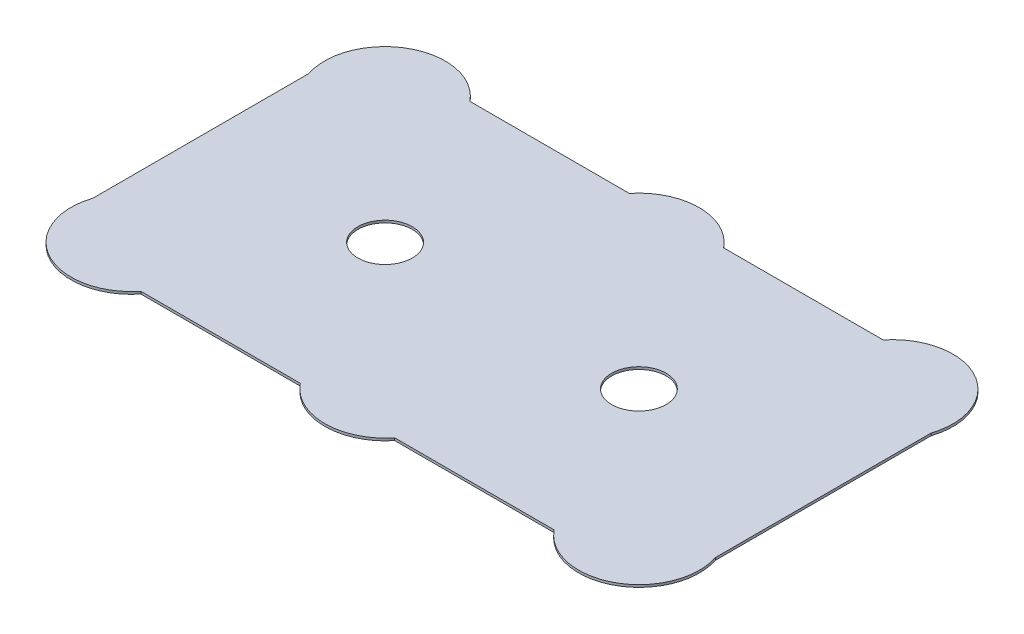
ISO-10303-21;
HEADER;
FILE_DESCRIPTION(('STEP AP214'),'2;1');
FILE_NAME('part.step','',(''),(''),'','','');
FILE_SCHEMA(('AUTOMOTIVE_DESIGN { 1 0 10303 214 1 1 1 1 }'));
ENDSEC;
DATA;
#1=APPLICATION_CONTEXT('core data for automotive mechanical design processes');
#2=APPLICATION_PROTOCOL_DEFINITION('international standard','automotive_design',2000,#1);
#3=PRODUCT_CONTEXT('',#1,'mechanical');
#4=PRODUCT('Part','Part','',(#3));
#5=PRODUCT_RELATED_PRODUCT_CATEGORY('part','',(#4));
#6=PRODUCT_DEFINITION_FORMATION('','',#4);
#7=PRODUCT_DEFINITION_CONTEXT('part definition',#1,'design');
#8=PRODUCT_DEFINITION('design','',#6,#7);
#9=PRODUCT_DEFINITION_SHAPE('','',#8);
#10=(LENGTH_UNIT() NAMED_UNIT(*) SI_UNIT(.MILLI.,.METRE.));
#11=(NAMED_UNIT(*) PLANE_ANGLE_UNIT() SI_UNIT($,.RADIAN.));
#12=(NAMED_UNIT(*) SI_UNIT($,.STERADIAN.) SOLID_ANGLE_UNIT());
#13=UNCERTAINTY_MEASURE_WITH_UNIT(LENGTH_MEASURE(1.E-05),#10,'distance_accuracy_value','');
#14=(GEOMETRIC_REPRESENTATION_CONTEXT(3) GLOBAL_UNCERTAINTY_ASSIGNED_CONTEXT((#13)) GLOBAL_UNIT_ASSIGNED_CONTEXT((#10,
#11,#12)) REPRESENTATION_CONTEXT('',''));
#15=CARTESIAN_POINT('',(0.,0.,0.));
#16=DIRECTION('',(0.,0.,1.));
#17=DIRECTION('',(1.,0.,0.));
#18=AXIS2_PLACEMENT_3D('',#15,#16,#17);
#19=CARTESIAN_POINT('',(0.,0.2,-29.095));
#20=DIRECTION('',(0.,0.,-1.));
#21=DIRECTION('',(-1.,0.,0.));
#22=AXIS2_PLACEMENT_3D('',#19,#20,#21);
#23=PLANE('',#22);
#24=DIRECTION('',(1.,0.,0.));
#25=VECTOR('',#24,1.);
#26=CARTESIAN_POINT('',(0.,0.,-29.095));
#27=LINE('',#26,#25);
#28=CARTESIAN_POINT('',(29.903123748999,0.,-29.095));
#29=VERTEX_POINT('',#28);
#30=CARTESIAN_POINT('',(43.096876251001,0.,-29.095));
#31=VERTEX_POINT('',#30);
#32=EDGE_CURVE('E161',#29,#31,#27,.T.);
#33=ORIENTED_EDGE('',*,*,#32,.F.);
#34=DIRECTION('',(0.,-1.,0.));
#35=VECTOR('',#34,1.);
#36=CARTESIAN_POINT('',(29.903123748999,0.2,-29.095));
#37=LINE('',#36,#35);
#38=CARTESIAN_POINT('',(29.903123748999,0.2,-29.095));
#39=VERTEX_POINT('',#38);
#40=EDGE_CURVE('E11',#39,#29,#37,.T.);
#41=ORIENTED_EDGE('',*,*,#40,.F.);
#42=DIRECTION('',(1.,0.,0.));
#43=VECTOR('',#42,1.);
#44=CARTESIAN_POINT('',(0.,0.2,-29.095));
#45=LINE('',#44,#43);
#46=CARTESIAN_POINT('',(43.096876251001,0.2,-29.095));
#47=VERTEX_POINT('',#46);
#48=EDGE_CURVE('E237',#39,#47,#45,.T.);
#49=ORIENTED_EDGE('',*,*,#48,.T.);
#50=DIRECTION('',(0.,-1.,0.));
#51=VECTOR('',#50,1.);
#52=CARTESIAN_POINT('',(43.096876251001,0.2,-29.095));
#53=LINE('',#52,#51);
#54=EDGE_CURVE('E100',#47,#31,#53,.T.);
#55=ORIENTED_EDGE('',*,*,#54,.T.);
#56=EDGE_LOOP('',(#33,#41,#49,#55));
#57=FACE_BOUND('',#56,.T.);
#58=ADVANCED_FACE('F37',(#57),#23,.T.);
#59=CARTESIAN_POINT('',(26.,0.2,-25.97));
#60=DIRECTION('',(0.,-1.,0.));
#61=DIRECTION('',(0.,0.,-1.));
#62=AXIS2_PLACEMENT_3D('',#59,#60,#61);
#63=CYLINDRICAL_SURFACE('',#62,5.);
#64=CARTESIAN_POINT('',(26.,0.,-25.97));
#65=DIRECTION('',(0.,1.,0.));
#66=DIRECTION('',(0.,0.,1.));
#67=AXIS2_PLACEMENT_3D('',#64,#65,#66);
#68=CIRCLE('',#67,5.);
#69=CARTESIAN_POINT('',(22.096876251001,0.,-29.095));
#70=VERTEX_POINT('',#69);
#71=EDGE_CURVE('E164',#29,#70,#68,.T.);
#72=ORIENTED_EDGE('',*,*,#71,.T.);
#73=DIRECTION('',(0.,-1.,0.));
#74=VECTOR('',#73,1.);
#75=CARTESIAN_POINT('',(22.096876251001,0.2,-29.095));
#76=LINE('',#75,#74);
#77=CARTESIAN_POINT('',(22.096876251001,0.2,-29.095));
#78=VERTEX_POINT('',#77);
#79=EDGE_CURVE('E46',#78,#70,#76,.T.);
#80=ORIENTED_EDGE('',*,*,#79,.F.);
#81=CARTESIAN_POINT('',(26.,0.2,-25.97));
#82=DIRECTION('',(0.,1.,0.));
#83=DIRECTION('',(0.,0.,1.));
#84=AXIS2_PLACEMENT_3D('',#81,#82,#83);
#85=CIRCLE('',#84,5.);
#86=EDGE_CURVE('E235',#39,#78,#85,.T.);
#87=ORIENTED_EDGE('',*,*,#86,.F.);
#88=ORIENTED_EDGE('',*,*,#40,.T.);
#89=EDGE_LOOP('',(#72,#80,#87,#88));
#90=FACE_BOUND('',#89,.T.);
#91=ADVANCED_FACE('F222',(#90),#63,.T.);
#92=CARTESIAN_POINT('',(0.,0.2,-29.095));
#93=DIRECTION('',(0.,0.,-1.));
#94=DIRECTION('',(-1.,0.,0.));
#95=AXIS2_PLACEMENT_3D('',#92,#93,#94);
#96=PLANE('',#95);
#97=DIRECTION('',(1.,0.,0.));
#98=VECTOR('',#97,1.);
#99=CARTESIAN_POINT('',(0.,0.,-29.095));
#100=LINE('',#99,#98);
#101=CARTESIAN_POINT('',(8.903123748999,0.,-29.095));
#102=VERTEX_POINT('',#101);
#103=EDGE_CURVE('E167',#102,#70,#100,.T.);
#104=ORIENTED_EDGE('',*,*,#103,.F.);
#105=DIRECTION('',(0.,-1.,0.));
#106=VECTOR('',#105,1.);
#107=CARTESIAN_POINT('',(8.903123748999,0.2,-29.095));
#108=LINE('',#107,#106);
#109=CARTESIAN_POINT('',(8.903123748999,0.2,-29.095));
#110=VERTEX_POINT('',#109);
#111=EDGE_CURVE('E212',#110,#102,#108,.T.);
#112=ORIENTED_EDGE('',*,*,#111,.F.);
#113=DIRECTION('',(1.,0.,0.));
#114=VECTOR('',#113,1.);
#115=CARTESIAN_POINT('',(0.,0.2,-29.095));
#116=LINE('',#115,#114);
#117=EDGE_CURVE('E219',#110,#78,#116,.T.);
#118=ORIENTED_EDGE('',*,*,#117,.T.);
#119=ORIENTED_EDGE('',*,*,#79,.T.);
#120=EDGE_LOOP('',(#104,#112,#118,#119));
#121=FACE_BOUND('',#120,.T.);
#122=ADVANCED_FACE('F217',(#121),#96,.T.);
#123=CARTESIAN_POINT('',(5.,0.2,-25.97));
#124=DIRECTION('',(0.,-1.,0.));
#125=DIRECTION('',(0.,0.,-1.));
#126=AXIS2_PLACEMENT_3D('',#123,#124,#125);
#127=CYLINDRICAL_SURFACE('',#126,5.);
#128=CARTESIAN_POINT('',(5.,0.,-25.97));
#129=DIRECTION('',(0.,1.,0.));
#130=DIRECTION('',(0.,0.,1.));
#131=AXIS2_PLACEMENT_3D('',#128,#129,#130);
#132=CIRCLE('',#131,5.);
#133=CARTESIAN_POINT('',(0.25,0.,-24.4087505004004));
#134=VERTEX_POINT('',#133);
#135=EDGE_CURVE('E170',#102,#134,#132,.T.);
#136=ORIENTED_EDGE('',*,*,#135,.T.);
#137=DIRECTION('',(0.,-1.,0.));
#138=VECTOR('',#137,1.);
#139=CARTESIAN_POINT('',(0.25,0.2,-24.4087505004004));
#140=LINE('',#139,#138);
#141=CARTESIAN_POINT('',(0.25,0.2,-24.4087505004004));
#142=VERTEX_POINT('',#141);
#143=EDGE_CURVE('E209',#142,#134,#140,.T.);
#144=ORIENTED_EDGE('',*,*,#143,.F.);
#145=CARTESIAN_POINT('',(5.,0.2,-25.97));
#146=DIRECTION('',(0.,1.,0.));
#147=DIRECTION('',(0.,0.,1.));
#148=AXIS2_PLACEMENT_3D('',#145,#146,#147);
#149=CIRCLE('',#148,5.);
#150=EDGE_CURVE('E231',#110,#142,#149,.T.);
#151=ORIENTED_EDGE('',*,*,#150,.F.);
#152=ORIENTED_EDGE('',*,*,#111,.T.);
#153=EDGE_LOOP('',(#136,#144,#151,#152));
#154=FACE_BOUND('',#153,.T.);
#155=ADVANCED_FACE('F228',(#154),#127,.T.);
#156=CARTESIAN_POINT('',(0.250000000000004,0.2,0.));
#157=DIRECTION('',(1.,0.,0.));
#158=DIRECTION('',(0.,0.,-1.));
#159=AXIS2_PLACEMENT_3D('',#156,#157,#158);
#160=PLANE('',#159);
#161=DIRECTION('',(0.,0.,1.));
#162=VECTOR('',#161,1.);
#163=CARTESIAN_POINT('',(0.250000000000004,0.,0.));
#164=LINE('',#163,#162);
#165=CARTESIAN_POINT('',(0.250000000000003,0.,-6.56124949959961));
#166=VERTEX_POINT('',#165);
#167=EDGE_CURVE('E173',#134,#166,#164,.T.);
#168=ORIENTED_EDGE('',*,*,#167,.T.);
#169=DIRECTION('',(0.,-1.,0.));
#170=VECTOR('',#169,1.);
#171=CARTESIAN_POINT('',(0.250000000000003,0.2,-6.56124949959961));
#172=LINE('',#171,#170);
#173=CARTESIAN_POINT('',(0.250000000000003,0.2,-6.56124949959961));
#174=VERTEX_POINT('',#173);
#175=EDGE_CURVE('E206',#174,#166,#172,.T.);
#176=ORIENTED_EDGE('',*,*,#175,.F.);
#177=DIRECTION('',(0.,0.,1.));
#178=VECTOR('',#177,1.);
#179=CARTESIAN_POINT('',(0.250000000000004,0.2,0.));
#180=LINE('',#179,#178);
#181=EDGE_CURVE('E233',#142,#174,#180,.T.);
#182=ORIENTED_EDGE('',*,*,#181,.F.);
#183=ORIENTED_EDGE('',*,*,#143,.T.);
#184=EDGE_LOOP('',(#168,#176,#182,#183));
#185=FACE_BOUND('',#184,.T.);
#186=ADVANCED_FACE('F292',(#185),#160,.F.);
#187=CARTESIAN_POINT('',(5.,0.2,-5.));
#188=DIRECTION('',(0.,-1.,0.));
#189=DIRECTION('',(0.,0.,-1.));
#190=AXIS2_PLACEMENT_3D('',#187,#188,#189);
#191=CYLINDRICAL_SURFACE('',#190,5.);
#192=CARTESIAN_POINT('',(5.,0.,-5.));
#193=DIRECTION('',(0.,1.,0.));
#194=DIRECTION('',(0.,0.,1.));
#195=AXIS2_PLACEMENT_3D('',#192,#193,#194);
#196=CIRCLE('',#195,5.);
#197=CARTESIAN_POINT('',(8.903123748999,0.,-1.875));
#198=VERTEX_POINT('',#197);
#199=EDGE_CURVE('E176',#166,#198,#196,.T.);
#200=ORIENTED_EDGE('',*,*,#199,.T.);
#201=DIRECTION('',(0.,-1.,0.));
#202=VECTOR('',#201,1.);
#203=CARTESIAN_POINT('',(8.903123748999,0.2,-1.875));
#204=LINE('',#203,#202);
#205=CARTESIAN_POINT('',(8.903123748999,0.2,-1.875));
#206=VERTEX_POINT('',#205);
#207=EDGE_CURVE('E203',#206,#198,#204,.T.);
#208=ORIENTED_EDGE('',*,*,#207,.F.);
#209=CARTESIAN_POINT('',(5.,0.2,-5.));
#210=DIRECTION('',(0.,1.,0.));
#211=DIRECTION('',(0.,0.,1.));
#212=AXIS2_PLACEMENT_3D('',#209,#210,#211);
#213=CIRCLE('',#212,5.);
#214=EDGE_CURVE('E242',#174,#206,#213,.T.);
#215=ORIENTED_EDGE('',*,*,#214,.F.);
#216=ORIENTED_EDGE('',*,*,#175,.T.);
#217=EDGE_LOOP('',(#200,#208,#215,#216));
#218=FACE_BOUND('',#217,.T.);
#219=ADVANCED_FACE('F295',(#218),#191,.T.);
#220=CARTESIAN_POINT('',(0.,0.2,-1.875));
#221=DIRECTION('',(0.,0.,-1.));
#222=DIRECTION('',(-1.,0.,0.));
#223=AXIS2_PLACEMENT_3D('',#220,#221,#222);
#224=PLANE('',#223);
#225=DIRECTION('',(1.,0.,0.));
#226=VECTOR('',#225,1.);
#227=CARTESIAN_POINT('',(0.,0.,-1.875));
#228=LINE('',#227,#226);
#229=CARTESIAN_POINT('',(22.096876251001,0.,-1.875));
#230=VERTEX_POINT('',#229);
#231=EDGE_CURVE('E179',#198,#230,#228,.T.);
#232=ORIENTED_EDGE('',*,*,#231,.T.);
#233=DIRECTION('',(0.,-1.,0.));
#234=VECTOR('',#233,1.);
#235=CARTESIAN_POINT('',(22.096876251001,0.2,-1.875));
#236=LINE('',#235,#234);
#237=CARTESIAN_POINT('',(22.096876251001,0.2,-1.875));
#238=VERTEX_POINT('',#237);
#239=EDGE_CURVE('E200',#238,#230,#236,.T.);
#240=ORIENTED_EDGE('',*,*,#239,.F.);
#241=DIRECTION('',(1.,0.,0.));
#242=VECTOR('',#241,1.);
#243=CARTESIAN_POINT('',(0.,0.2,-1.875));
#244=LINE('',#243,#242);
#245=EDGE_CURVE('E245',#206,#238,#244,.T.);
#246=ORIENTED_EDGE('',*,*,#245,.F.);
#247=ORIENTED_EDGE('',*,*,#207,.T.);
#248=EDGE_LOOP('',(#232,#240,#246,#247));
#249=FACE_BOUND('',#248,.T.);
#250=ADVANCED_FACE('F299',(#249),#224,.F.);
#251=CARTESIAN_POINT('',(26.,0.2,-5.));
#252=DIRECTION('',(0.,-1.,0.));
#253=DIRECTION('',(0.,0.,-1.));
#254=AXIS2_PLACEMENT_3D('',#251,#252,#253);
#255=CYLINDRICAL_SURFACE('',#254,5.);
#256=CARTESIAN_POINT('',(26.,0.,-5.));
#257=DIRECTION('',(0.,1.,0.));
#258=DIRECTION('',(0.,0.,1.));
#259=AXIS2_PLACEMENT_3D('',#256,#257,#258);
#260=CIRCLE('',#259,5.);
#261=CARTESIAN_POINT('',(29.903123748999,0.,-1.875));
#262=VERTEX_POINT('',#261);
#263=EDGE_CURVE('E182',#230,#262,#260,.T.);
#264=ORIENTED_EDGE('',*,*,#263,.T.);
#265=DIRECTION('',(0.,-1.,0.));
#266=VECTOR('',#265,1.);
#267=CARTESIAN_POINT('',(29.903123748999,0.2,-1.875));
#268=LINE('',#267,#266);
#269=CARTESIAN_POINT('',(29.903123748999,0.2,-1.875));
#270=VERTEX_POINT('',#269);
#271=EDGE_CURVE('E197',#270,#262,#268,.T.);
#272=ORIENTED_EDGE('',*,*,#271,.F.);
#273=CARTESIAN_POINT('',(26.,0.2,-5.));
#274=DIRECTION('',(0.,1.,0.));
#275=DIRECTION('',(0.,0.,1.));
#276=AXIS2_PLACEMENT_3D('',#273,#274,#275);
#277=CIRCLE('',#276,5.);
#278=EDGE_CURVE('E248',#238,#270,#277,.T.);
#279=ORIENTED_EDGE('',*,*,#278,.F.);
#280=ORIENTED_EDGE('',*,*,#239,.T.);
#281=EDGE_LOOP('',(#264,#272,#279,#280));
#282=FACE_BOUND('',#281,.T.);
#283=ADVANCED_FACE('F252',(#282),#255,.T.);
#284=CARTESIAN_POINT('',(0.,0.2,-1.875));
#285=DIRECTION('',(0.,0.,-1.));
#286=DIRECTION('',(-1.,0.,0.));
#287=AXIS2_PLACEMENT_3D('',#284,#285,#286);
#288=PLANE('',#287);
#289=DIRECTION('',(1.,0.,0.));
#290=VECTOR('',#289,1.);
#291=CARTESIAN_POINT('',(0.,0.,-1.875));
#292=LINE('',#291,#290);
#293=CARTESIAN_POINT('',(43.096876251001,0.,-1.875));
#294=VERTEX_POINT('',#293);
#295=EDGE_CURVE('E185',#262,#294,#292,.T.);
#296=ORIENTED_EDGE('',*,*,#295,.T.);
#297=DIRECTION('',(0.,-1.,0.));
#298=VECTOR('',#297,1.);
#299=CARTESIAN_POINT('',(43.096876251001,0.2,-1.875));
#300=LINE('',#299,#298);
#301=CARTESIAN_POINT('',(43.096876251001,0.2,-1.875));
#302=VERTEX_POINT('',#301);
#303=EDGE_CURVE('E148',#302,#294,#300,.T.);
#304=ORIENTED_EDGE('',*,*,#303,.F.);
#305=DIRECTION('',(1.,0.,0.));
#306=VECTOR('',#305,1.);
#307=CARTESIAN_POINT('',(0.,0.2,-1.875));
#308=LINE('',#307,#306);
#309=EDGE_CURVE('E136',#270,#302,#308,.T.);
#310=ORIENTED_EDGE('',*,*,#309,.F.);
#311=ORIENTED_EDGE('',*,*,#271,.T.);
#312=EDGE_LOOP('',(#296,#304,#310,#311));
#313=FACE_BOUND('',#312,.T.);
#314=ADVANCED_FACE('F254',(#313),#288,.F.);
#315=CARTESIAN_POINT('',(47.,0.2,-5.));
#316=DIRECTION('',(0.,-1.,0.));
#317=DIRECTION('',(0.,0.,-1.));
#318=AXIS2_PLACEMENT_3D('',#315,#316,#317);
#319=CYLINDRICAL_SURFACE('',#318,5.);
#320=CARTESIAN_POINT('',(47.,0.,-5.));
#321=DIRECTION('',(0.,1.,0.));
#322=DIRECTION('',(0.,0.,1.));
#323=AXIS2_PLACEMENT_3D('',#320,#321,#322);
#324=CIRCLE('',#323,5.);
#325=CARTESIAN_POINT('',(51.75,0.,-6.56124949959956));
#326=VERTEX_POINT('',#325);
#327=EDGE_CURVE('E144',#294,#326,#324,.T.);
#328=ORIENTED_EDGE('',*,*,#327,.T.);
#329=DIRECTION('',(0.,-1.,0.));
#330=VECTOR('',#329,1.);
#331=CARTESIAN_POINT('',(51.75,0.2,-6.56124949959956));
#332=LINE('',#331,#330);
#333=CARTESIAN_POINT('',(51.75,0.2,-6.56124949959956));
#334=VERTEX_POINT('',#333);
#335=EDGE_CURVE('E142',#334,#326,#332,.T.);
#336=ORIENTED_EDGE('',*,*,#335,.F.);
#337=CARTESIAN_POINT('',(47.,0.2,-5.));
#338=DIRECTION('',(0.,1.,0.));
#339=DIRECTION('',(0.,0.,1.));
#340=AXIS2_PLACEMENT_3D('',#337,#338,#339);
#341=CIRCLE('',#340,5.);
#342=EDGE_CURVE('E130',#302,#334,#341,.T.);
#343=ORIENTED_EDGE('',*,*,#342,.F.);
#344=ORIENTED_EDGE('',*,*,#303,.T.);
#345=EDGE_LOOP('',(#328,#336,#343,#344));
#346=FACE_BOUND('',#345,.T.);
#347=ADVANCED_FACE('F143',(#346),#319,.T.);
#348=CARTESIAN_POINT('',(51.75,0.2,0.));
#349=DIRECTION('',(1.,0.,0.));
#350=DIRECTION('',(0.,0.,-1.));
#351=AXIS2_PLACEMENT_3D('',#348,#349,#350);
#352=PLANE('',#351);
#353=DIRECTION('',(0.,0.,1.));
#354=VECTOR('',#353,1.);
#355=CARTESIAN_POINT('',(51.75,0.,0.));
#356=LINE('',#355,#354);
#357=CARTESIAN_POINT('',(51.75,0.,-24.4087505004004));
#358=VERTEX_POINT('',#357);
#359=EDGE_CURVE('E189',#358,#326,#356,.T.);
#360=ORIENTED_EDGE('',*,*,#359,.F.);
#361=DIRECTION('',(0.,-1.,0.));
#362=VECTOR('',#361,1.);
#363=CARTESIAN_POINT('',(51.75,0.2,-24.4087505004004));
#364=LINE('',#363,#362);
#365=CARTESIAN_POINT('',(51.75,0.2,-24.4087505004004));
#366=VERTEX_POINT('',#365);
#367=EDGE_CURVE('E93',#366,#358,#364,.T.);
#368=ORIENTED_EDGE('',*,*,#367,.F.);
#369=DIRECTION('',(0.,0.,1.));
#370=VECTOR('',#369,1.);
#371=CARTESIAN_POINT('',(51.75,0.2,0.));
#372=LINE('',#371,#370);
#373=EDGE_CURVE('E134',#366,#334,#372,.T.);
#374=ORIENTED_EDGE('',*,*,#373,.T.);
#375=ORIENTED_EDGE('',*,*,#335,.T.);
#376=EDGE_LOOP('',(#360,#368,#374,#375));
#377=FACE_BOUND('',#376,.T.);
#378=ADVANCED_FACE('F150',(#377),#352,.T.);
#379=CARTESIAN_POINT('',(36.5,0.2,-15.485));
#380=DIRECTION('',(0.,-1.,0.));
#381=DIRECTION('',(0.,0.,-1.));
#382=AXIS2_PLACEMENT_3D('',#379,#380,#381);
#383=CYLINDRICAL_SURFACE('',#382,2.25000000000001);
#384=CARTESIAN_POINT('',(36.5,0.2,-15.485));
#385=DIRECTION('',(0.,1.,0.));
#386=DIRECTION('',(0.,0.,1.));
#387=AXIS2_PLACEMENT_3D('',#384,#385,#386);
#388=CIRCLE('',#387,2.25000000000001);
#389=CARTESIAN_POINT('',(36.5,0.2,-13.235));
#390=VERTEX_POINT('',#389);
#391=EDGE_CURVE('E256',#390,#390,#388,.T.);
#392=ORIENTED_EDGE('',*,*,#391,.T.);
#393=EDGE_LOOP('',(#392));
#394=FACE_BOUND('',#393,.T.);
#395=CARTESIAN_POINT('',(36.5,0.,-15.485));
#396=DIRECTION('',(0.,1.,0.));
#397=DIRECTION('',(0.,0.,1.));
#398=AXIS2_PLACEMENT_3D('',#395,#396,#397);
#399=CIRCLE('',#398,2.25000000000001);
#400=CARTESIAN_POINT('',(36.5,0.,-13.235));
#401=VERTEX_POINT('',#400);
#402=EDGE_CURVE('E158',#401,#401,#399,.T.);
#403=ORIENTED_EDGE('',*,*,#402,.F.);
#404=EDGE_LOOP('',(#403));
#405=FACE_BOUND('',#404,.T.);
#406=ADVANCED_FACE('F270',(#394,#405),#383,.F.);
#407=CARTESIAN_POINT('',(15.5,0.2,-15.485));
#408=DIRECTION('',(0.,-1.,0.));
#409=DIRECTION('',(0.,0.,-1.));
#410=AXIS2_PLACEMENT_3D('',#407,#408,#409);
#411=CYLINDRICAL_SURFACE('',#410,2.25000000000001);
#412=CARTESIAN_POINT('',(15.5,0.2,-15.485));
#413=DIRECTION('',(0.,1.,0.));
#414=DIRECTION('',(0.,0.,1.));
#415=AXIS2_PLACEMENT_3D('',#412,#413,#414);
#416=CIRCLE('',#415,2.25000000000001);
#417=CARTESIAN_POINT('',(15.5,0.2,-13.235));
#418=VERTEX_POINT('',#417);
#419=EDGE_CURVE('E193',#418,#418,#416,.T.);
#420=ORIENTED_EDGE('',*,*,#419,.T.);
#421=EDGE_LOOP('',(#420));
#422=FACE_BOUND('',#421,.T.);
#423=CARTESIAN_POINT('',(15.5,0.,-15.485));
#424=DIRECTION('',(0.,1.,0.));
#425=DIRECTION('',(0.,0.,1.));
#426=AXIS2_PLACEMENT_3D('',#423,#424,#425);
#427=CIRCLE('',#426,2.25000000000001);
#428=CARTESIAN_POINT('',(15.5,0.,-13.235));
#429=VERTEX_POINT('',#428);
#430=EDGE_CURVE('E155',#429,#429,#427,.T.);
#431=ORIENTED_EDGE('',*,*,#430,.F.);
#432=EDGE_LOOP('',(#431));
#433=FACE_BOUND('',#432,.T.);
#434=ADVANCED_FACE('F39',(#422,#433),#411,.F.);
#435=CARTESIAN_POINT('',(47.,0.2,-25.97));
#436=DIRECTION('',(0.,-1.,0.));
#437=DIRECTION('',(0.,0.,-1.));
#438=AXIS2_PLACEMENT_3D('',#435,#436,#437);
#439=CYLINDRICAL_SURFACE('',#438,5.);
#440=CARTESIAN_POINT('',(47.,0.,-25.97));
#441=DIRECTION('',(0.,1.,0.));
#442=DIRECTION('',(0.,0.,1.));
#443=AXIS2_PLACEMENT_3D('',#440,#441,#442);
#444=CIRCLE('',#443,5.);
#445=EDGE_CURVE('E191',#358,#31,#444,.T.);
#446=ORIENTED_EDGE('',*,*,#445,.T.);
#447=ORIENTED_EDGE('',*,*,#54,.F.);
#448=CARTESIAN_POINT('',(47.,0.2,-25.97));
#449=DIRECTION('',(0.,1.,0.));
#450=DIRECTION('',(0.,0.,1.));
#451=AXIS2_PLACEMENT_3D('',#448,#449,#450);
#452=CIRCLE('',#451,5.);
#453=EDGE_CURVE('E54',#366,#47,#452,.T.);
#454=ORIENTED_EDGE('',*,*,#453,.F.);
#455=ORIENTED_EDGE('',*,*,#367,.T.);
#456=EDGE_LOOP('',(#446,#447,#454,#455));
#457=FACE_BOUND('',#456,.T.);
#458=ADVANCED_FACE('F255',(#457),#439,.T.);
#459=CARTESIAN_POINT('',(0.,0.2,0.));
#460=DIRECTION('',(0.,1.,0.));
#461=DIRECTION('',(0.,0.,1.));
#462=AXIS2_PLACEMENT_3D('',#459,#460,#461);
#463=PLANE('',#462);
#464=ORIENTED_EDGE('',*,*,#419,.F.);
#465=EDGE_LOOP('',(#464));
#466=FACE_BOUND('',#465,.T.);
#467=ORIENTED_EDGE('',*,*,#391,.F.);
#468=EDGE_LOOP('',(#467));
#469=FACE_BOUND('',#468,.T.);
#470=ORIENTED_EDGE('',*,*,#48,.F.);
#471=ORIENTED_EDGE('',*,*,#86,.T.);
#472=ORIENTED_EDGE('',*,*,#117,.F.);
#473=ORIENTED_EDGE('',*,*,#150,.T.);
#474=ORIENTED_EDGE('',*,*,#181,.T.);
#475=ORIENTED_EDGE('',*,*,#214,.T.);
#476=ORIENTED_EDGE('',*,*,#245,.T.);
#477=ORIENTED_EDGE('',*,*,#278,.T.);
#478=ORIENTED_EDGE('',*,*,#309,.T.);
#479=ORIENTED_EDGE('',*,*,#342,.T.);
#480=ORIENTED_EDGE('',*,*,#373,.F.);
#481=ORIENTED_EDGE('',*,*,#453,.T.);
#482=EDGE_LOOP('',(#470,#471,#472,#473,#474,#475,#476,#477,#478,#479,#480,#481));
#483=FACE_BOUND('',#482,.T.);
#484=ADVANCED_FACE('F132',(#466,#469,#483),#463,.T.);
#485=CARTESIAN_POINT('',(0.,0.,0.));
#486=DIRECTION('',(0.,1.,0.));
#487=DIRECTION('',(0.,0.,1.));
#488=AXIS2_PLACEMENT_3D('',#485,#486,#487);
#489=PLANE('',#488);
#490=ORIENTED_EDGE('',*,*,#430,.T.);
#491=EDGE_LOOP('',(#490));
#492=FACE_BOUND('',#491,.T.);
#493=ORIENTED_EDGE('',*,*,#402,.T.);
#494=EDGE_LOOP('',(#493));
#495=FACE_BOUND('',#494,.T.);
#496=ORIENTED_EDGE('',*,*,#32,.T.);
#497=ORIENTED_EDGE('',*,*,#445,.F.);
#498=ORIENTED_EDGE('',*,*,#359,.T.);
#499=ORIENTED_EDGE('',*,*,#327,.F.);
#500=ORIENTED_EDGE('',*,*,#295,.F.);
#501=ORIENTED_EDGE('',*,*,#263,.F.);
#502=ORIENTED_EDGE('',*,*,#231,.F.);
#503=ORIENTED_EDGE('',*,*,#199,.F.);
#504=ORIENTED_EDGE('',*,*,#167,.F.);
#505=ORIENTED_EDGE('',*,*,#135,.F.);
#506=ORIENTED_EDGE('',*,*,#103,.T.);
#507=ORIENTED_EDGE('',*,*,#71,.F.);
#508=EDGE_LOOP('',(#496,#497,#498,#499,#500,#501,#502,#503,#504,#505,#506,#507));
#509=FACE_BOUND('',#508,.T.);
#510=ADVANCED_FACE('F225',(#492,#495,#509),#489,.F.);
#511=CLOSED_SHELL('',(#58,#91,#122,#155,#186,#219,#250,#283,#314,#347,#378,#406,#434,#458,#484,#510));
#512=MANIFOLD_SOLID_BREP('B2',#511);
#513=ADVANCED_BREP_SHAPE_REPRESENTATION('',(#18,#512),#14);
#514=SHAPE_DEFINITION_REPRESENTATION(#9,#513);
ENDSEC;
END-ISO-10303-21;
